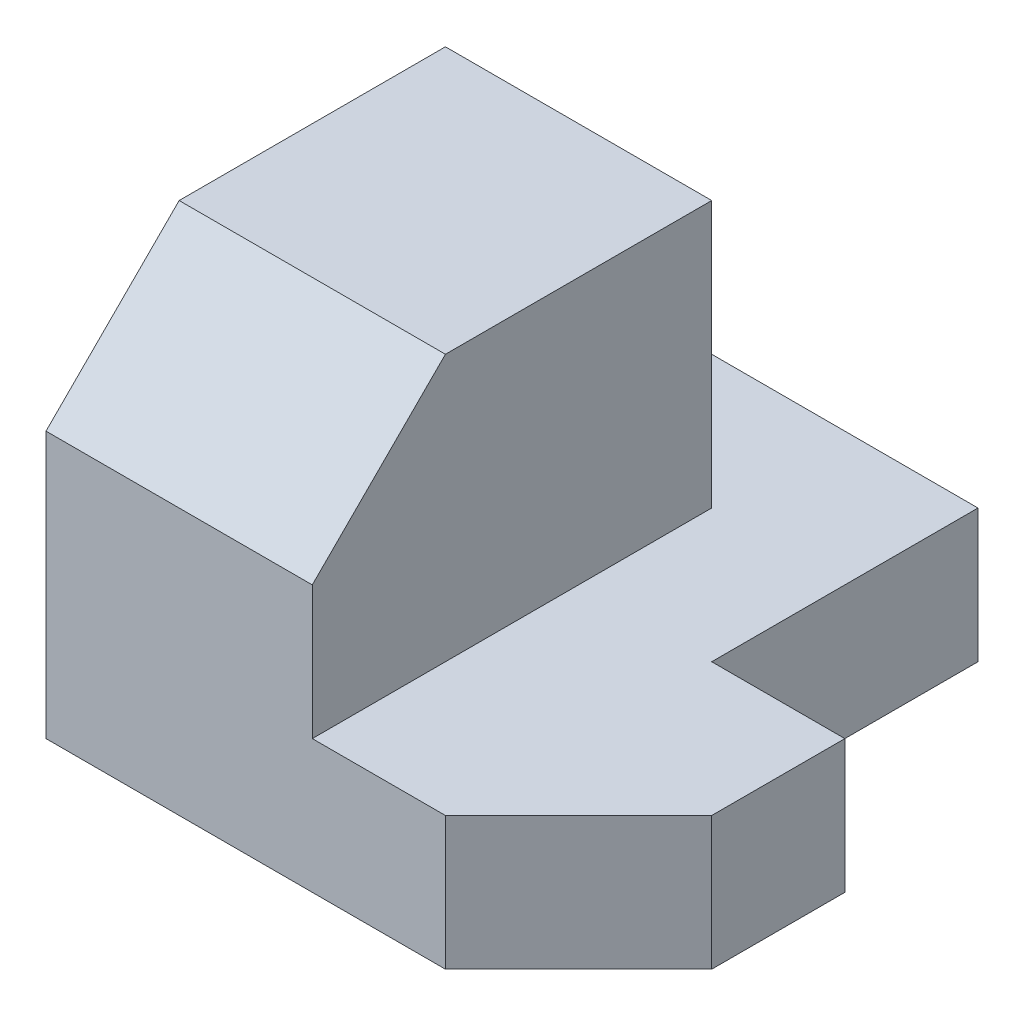
ISO-10303-21;
HEADER;
FILE_DESCRIPTION(('STEP AP214'),'2;1');
FILE_NAME('part.step','',(''),(''),'','','');
FILE_SCHEMA(('AUTOMOTIVE_DESIGN { 1 0 10303 214 1 1 1 1 }'));
ENDSEC;
DATA;
#1=APPLICATION_CONTEXT('core data for automotive mechanical design processes');
#2=APPLICATION_PROTOCOL_DEFINITION('international standard','automotive_design',2000,#1);
#3=PRODUCT_CONTEXT('',#1,'mechanical');
#4=PRODUCT('Part','Part','',(#3));
#5=PRODUCT_RELATED_PRODUCT_CATEGORY('part','',(#4));
#6=PRODUCT_DEFINITION_FORMATION('','',#4);
#7=PRODUCT_DEFINITION_CONTEXT('part definition',#1,'design');
#8=PRODUCT_DEFINITION('design','',#6,#7);
#9=PRODUCT_DEFINITION_SHAPE('','',#8);
#10=(LENGTH_UNIT() NAMED_UNIT(*) SI_UNIT(.MILLI.,.METRE.));
#11=(NAMED_UNIT(*) PLANE_ANGLE_UNIT() SI_UNIT($,.RADIAN.));
#12=(NAMED_UNIT(*) SI_UNIT($,.STERADIAN.) SOLID_ANGLE_UNIT());
#13=UNCERTAINTY_MEASURE_WITH_UNIT(LENGTH_MEASURE(1.E-05),#10,'distance_accuracy_value','');
#14=(GEOMETRIC_REPRESENTATION_CONTEXT(3) GLOBAL_UNCERTAINTY_ASSIGNED_CONTEXT((#13)) GLOBAL_UNIT_ASSIGNED_CONTEXT((#10,
#11,#12)) REPRESENTATION_CONTEXT('',''));
#15=CARTESIAN_POINT('',(0.,0.,0.));
#16=DIRECTION('',(0.,0.,1.));
#17=DIRECTION('',(1.,0.,0.));
#18=AXIS2_PLACEMENT_3D('',#15,#16,#17);
#19=CARTESIAN_POINT('',(0.,254.,0.));
#20=DIRECTION('',(0.,0.,1.));
#21=DIRECTION('',(1.,0.,0.));
#22=AXIS2_PLACEMENT_3D('',#19,#20,#21);
#23=PLANE('',#22);
#24=DIRECTION('',(0.,-1.,0.));
#25=VECTOR('',#24,1.);
#26=CARTESIAN_POINT('',(508.,762.,0.));
#27=LINE('',#26,#25);
#28=CARTESIAN_POINT('',(508.,508.,0.));
#29=VERTEX_POINT('',#28);
#30=CARTESIAN_POINT('',(508.,254.,0.));
#31=VERTEX_POINT('',#30);
#32=EDGE_CURVE('E184',#29,#31,#27,.T.);
#33=ORIENTED_EDGE('',*,*,#32,.F.);
#34=DIRECTION('',(1.,0.,0.));
#35=VECTOR('',#34,1.);
#36=CARTESIAN_POINT('',(-2985.49194538493,508.,0.));
#37=LINE('',#36,#35);
#38=CARTESIAN_POINT('',(0.,508.,0.));
#39=VERTEX_POINT('',#38);
#40=EDGE_CURVE('E206',#39,#29,#37,.T.);
#41=ORIENTED_EDGE('',*,*,#40,.F.);
#42=DIRECTION('',(0.,-1.,0.));
#43=VECTOR('',#42,1.);
#44=CARTESIAN_POINT('',(0.,762.,0.));
#45=LINE('',#44,#43);
#46=CARTESIAN_POINT('',(0.,0.,0.));
#47=VERTEX_POINT('',#46);
#48=EDGE_CURVE('E137',#39,#47,#45,.T.);
#49=ORIENTED_EDGE('',*,*,#48,.T.);
#50=DIRECTION('',(-1.,0.,0.));
#51=VECTOR('',#50,1.);
#52=CARTESIAN_POINT('',(0.,0.,0.));
#53=LINE('',#52,#51);
#54=CARTESIAN_POINT('',(762.,0.,-1.11022302462516E-13));
#55=VERTEX_POINT('',#54);
#56=EDGE_CURVE('E133',#55,#47,#53,.T.);
#57=ORIENTED_EDGE('',*,*,#56,.F.);
#58=DIRECTION('',(0.,-1.,0.));
#59=VECTOR('',#58,1.);
#60=CARTESIAN_POINT('',(762.,254.,-1.11022302462516E-13));
#61=LINE('',#60,#59);
#62=CARTESIAN_POINT('',(762.,254.,-1.11022302462516E-13));
#63=VERTEX_POINT('',#62);
#64=EDGE_CURVE('E11',#63,#55,#61,.T.);
#65=ORIENTED_EDGE('',*,*,#64,.F.);
#66=DIRECTION('',(-1.,0.,0.));
#67=VECTOR('',#66,1.);
#68=CARTESIAN_POINT('',(0.,254.,0.));
#69=LINE('',#68,#67);
#70=EDGE_CURVE('E174',#63,#31,#69,.T.);
#71=ORIENTED_EDGE('',*,*,#70,.T.);
#72=EDGE_LOOP('',(#33,#41,#49,#57,#65,#71));
#73=FACE_BOUND('',#72,.T.);
#74=ADVANCED_FACE('F33',(#73),#23,.T.);
#75=CARTESIAN_POINT('',(0.,254.,0.));
#76=DIRECTION('',(-1.,0.,0.));
#77=DIRECTION('',(0.,0.,1.));
#78=AXIS2_PLACEMENT_3D('',#75,#76,#77);
#79=PLANE('',#78);
#80=ORIENTED_EDGE('',*,*,#48,.F.);
#81=DIRECTION('',(0.,-0.707106781186551,0.707106781186544));
#82=VECTOR('',#81,1.);
#83=CARTESIAN_POINT('',(0.,762.,-253.999999999997));
#84=LINE('',#83,#82);
#85=CARTESIAN_POINT('',(0.,762.,-253.999999999997));
#86=VERTEX_POINT('',#85);
#87=EDGE_CURVE('E201',#86,#39,#84,.T.);
#88=ORIENTED_EDGE('',*,*,#87,.F.);
#89=DIRECTION('',(0.,0.,-1.));
#90=VECTOR('',#89,1.);
#91=CARTESIAN_POINT('',(0.,762.,0.));
#92=LINE('',#91,#90);
#93=CARTESIAN_POINT('',(0.,762.,-762.));
#94=VERTEX_POINT('',#93);
#95=EDGE_CURVE('E198',#86,#94,#92,.T.);
#96=ORIENTED_EDGE('',*,*,#95,.T.);
#97=DIRECTION('',(0.,-1.,0.));
#98=VECTOR('',#97,1.);
#99=CARTESIAN_POINT('',(0.,762.,-762.));
#100=LINE('',#99,#98);
#101=CARTESIAN_POINT('',(0.,254.,-762.));
#102=VERTEX_POINT('',#101);
#103=EDGE_CURVE('E189',#94,#102,#100,.T.);
#104=ORIENTED_EDGE('',*,*,#103,.T.);
#105=DIRECTION('',(0.,0.,-1.));
#106=VECTOR('',#105,1.);
#107=CARTESIAN_POINT('',(0.,254.,0.));
#108=LINE('',#107,#106);
#109=CARTESIAN_POINT('',(0.,254.,-1016.));
#110=VERTEX_POINT('',#109);
#111=EDGE_CURVE('E56',#102,#110,#108,.T.);
#112=ORIENTED_EDGE('',*,*,#111,.T.);
#113=DIRECTION('',(0.,-1.,0.));
#114=VECTOR('',#113,1.);
#115=CARTESIAN_POINT('',(0.,254.,-1016.));
#116=LINE('',#115,#114);
#117=CARTESIAN_POINT('',(0.,0.,-1016.));
#118=VERTEX_POINT('',#117);
#119=EDGE_CURVE('E82',#110,#118,#116,.T.);
#120=ORIENTED_EDGE('',*,*,#119,.T.);
#121=DIRECTION('',(0.,0.,-1.));
#122=VECTOR('',#121,1.);
#123=CARTESIAN_POINT('',(0.,0.,0.));
#124=LINE('',#123,#122);
#125=EDGE_CURVE('E149',#47,#118,#124,.T.);
#126=ORIENTED_EDGE('',*,*,#125,.F.);
#127=EDGE_LOOP('',(#80,#88,#96,#104,#112,#120,#126));
#128=FACE_BOUND('',#127,.T.);
#129=ADVANCED_FACE('F233',(#128),#79,.T.);
#130=CARTESIAN_POINT('',(508.,762.,0.));
#131=DIRECTION('',(1.,0.,0.));
#132=DIRECTION('',(0.,0.,-1.));
#133=AXIS2_PLACEMENT_3D('',#130,#131,#132);
#134=PLANE('',#133);
#135=DIRECTION('',(0.,0.,1.));
#136=VECTOR('',#135,1.);
#137=CARTESIAN_POINT('',(508.,762.,0.));
#138=LINE('',#137,#136);
#139=CARTESIAN_POINT('',(508.,762.,-762.));
#140=VERTEX_POINT('',#139);
#141=CARTESIAN_POINT('',(508.,762.,-253.999999999997));
#142=VERTEX_POINT('',#141);
#143=EDGE_CURVE('E195',#140,#142,#138,.T.);
#144=ORIENTED_EDGE('',*,*,#143,.T.);
#145=DIRECTION('',(0.,-0.707106781186551,0.707106781186544));
#146=VECTOR('',#145,1.);
#147=CARTESIAN_POINT('',(508.,762.,-253.999999999997));
#148=LINE('',#147,#146);
#149=EDGE_CURVE('E47',#142,#29,#148,.T.);
#150=ORIENTED_EDGE('',*,*,#149,.T.);
#151=ORIENTED_EDGE('',*,*,#32,.T.);
#152=DIRECTION('',(0.,0.,1.));
#153=VECTOR('',#152,1.);
#154=CARTESIAN_POINT('',(508.,254.,0.));
#155=LINE('',#154,#153);
#156=CARTESIAN_POINT('',(508.,254.,-762.));
#157=VERTEX_POINT('',#156);
#158=EDGE_CURVE('E179',#157,#31,#155,.T.);
#159=ORIENTED_EDGE('',*,*,#158,.F.);
#160=DIRECTION('',(0.,-1.,0.));
#161=VECTOR('',#160,1.);
#162=CARTESIAN_POINT('',(508.,762.,-762.));
#163=LINE('',#162,#161);
#164=EDGE_CURVE('E186',#140,#157,#163,.T.);
#165=ORIENTED_EDGE('',*,*,#164,.F.);
#166=EDGE_LOOP('',(#144,#150,#151,#159,#165));
#167=FACE_BOUND('',#166,.T.);
#168=ADVANCED_FACE('F211',(#167),#134,.T.);
#169=CARTESIAN_POINT('',(0.,762.,0.));
#170=DIRECTION('',(0.,1.,0.));
#171=DIRECTION('',(0.,0.,1.));
#172=AXIS2_PLACEMENT_3D('',#169,#170,#171);
#173=PLANE('',#172);
#174=ORIENTED_EDGE('',*,*,#95,.F.);
#175=DIRECTION('',(1.,0.,0.));
#176=VECTOR('',#175,1.);
#177=CARTESIAN_POINT('',(-2985.49194538493,762.,-253.999999999997));
#178=LINE('',#177,#176);
#179=EDGE_CURVE('E204',#86,#142,#178,.T.);
#180=ORIENTED_EDGE('',*,*,#179,.T.);
#181=ORIENTED_EDGE('',*,*,#143,.F.);
#182=DIRECTION('',(1.,0.,0.));
#183=VECTOR('',#182,1.);
#184=CARTESIAN_POINT('',(0.,762.,-762.));
#185=LINE('',#184,#183);
#186=EDGE_CURVE('E192',#94,#140,#185,.T.);
#187=ORIENTED_EDGE('',*,*,#186,.F.);
#188=EDGE_LOOP('',(#174,#180,#181,#187));
#189=FACE_BOUND('',#188,.T.);
#190=ADVANCED_FACE('F227',(#189),#173,.T.);
#191=CARTESIAN_POINT('',(381.,254.,381.));
#192=DIRECTION('',(0.707106781186548,0.,0.707106781186548));
#193=DIRECTION('',(0.707106781186548,0.,-0.707106781186548));
#194=AXIS2_PLACEMENT_3D('',#191,#192,#193);
#195=PLANE('',#194);
#196=DIRECTION('',(-0.707106781186548,0.,0.707106781186548));
#197=VECTOR('',#196,1.);
#198=CARTESIAN_POINT('',(381.,0.,381.));
#199=LINE('',#198,#197);
#200=CARTESIAN_POINT('',(1016.,0.,-254.));
#201=VERTEX_POINT('',#200);
#202=EDGE_CURVE('E136',#201,#55,#199,.T.);
#203=ORIENTED_EDGE('',*,*,#202,.F.);
#204=DIRECTION('',(0.,-1.,0.));
#205=VECTOR('',#204,1.);
#206=CARTESIAN_POINT('',(1016.,254.,-254.));
#207=LINE('',#206,#205);
#208=CARTESIAN_POINT('',(1016.,254.,-254.));
#209=VERTEX_POINT('',#208);
#210=EDGE_CURVE('E40',#209,#201,#207,.T.);
#211=ORIENTED_EDGE('',*,*,#210,.F.);
#212=DIRECTION('',(-0.707106781186548,0.,0.707106781186548));
#213=VECTOR('',#212,1.);
#214=CARTESIAN_POINT('',(381.,254.,381.));
#215=LINE('',#214,#213);
#216=EDGE_CURVE('E172',#209,#63,#215,.T.);
#217=ORIENTED_EDGE('',*,*,#216,.T.);
#218=ORIENTED_EDGE('',*,*,#64,.T.);
#219=EDGE_LOOP('',(#203,#211,#217,#218));
#220=FACE_BOUND('',#219,.T.);
#221=ADVANCED_FACE('F164',(#220),#195,.T.);
#222=CARTESIAN_POINT('',(1016.,254.,0.));
#223=DIRECTION('',(1.,0.,0.));
#224=DIRECTION('',(0.,0.,-1.));
#225=AXIS2_PLACEMENT_3D('',#222,#223,#224);
#226=PLANE('',#225);
#227=DIRECTION('',(0.,0.,1.));
#228=VECTOR('',#227,1.);
#229=CARTESIAN_POINT('',(1016.,0.,0.));
#230=LINE('',#229,#228);
#231=CARTESIAN_POINT('',(1016.,0.,-508.));
#232=VERTEX_POINT('',#231);
#233=EDGE_CURVE('E140',#232,#201,#230,.T.);
#234=ORIENTED_EDGE('',*,*,#233,.F.);
#235=DIRECTION('',(0.,-1.,0.));
#236=VECTOR('',#235,1.);
#237=CARTESIAN_POINT('',(1016.,254.,-508.));
#238=LINE('',#237,#236);
#239=CARTESIAN_POINT('',(1016.,254.,-508.));
#240=VERTEX_POINT('',#239);
#241=EDGE_CURVE('E154',#240,#232,#238,.T.);
#242=ORIENTED_EDGE('',*,*,#241,.F.);
#243=DIRECTION('',(0.,0.,1.));
#244=VECTOR('',#243,1.);
#245=CARTESIAN_POINT('',(1016.,254.,0.));
#246=LINE('',#245,#244);
#247=EDGE_CURVE('E160',#240,#209,#246,.T.);
#248=ORIENTED_EDGE('',*,*,#247,.T.);
#249=ORIENTED_EDGE('',*,*,#210,.T.);
#250=EDGE_LOOP('',(#234,#242,#248,#249));
#251=FACE_BOUND('',#250,.T.);
#252=ADVANCED_FACE('F159',(#251),#226,.T.);
#253=CARTESIAN_POINT('',(0.,254.,-508.));
#254=DIRECTION('',(0.,0.,-1.));
#255=DIRECTION('',(-1.,0.,0.));
#256=AXIS2_PLACEMENT_3D('',#253,#254,#255);
#257=PLANE('',#256);
#258=DIRECTION('',(1.,0.,0.));
#259=VECTOR('',#258,1.);
#260=CARTESIAN_POINT('',(0.,0.,-508.));
#261=LINE('',#260,#259);
#262=CARTESIAN_POINT('',(762.,0.,-508.));
#263=VERTEX_POINT('',#262);
#264=EDGE_CURVE('E143',#263,#232,#261,.T.);
#265=ORIENTED_EDGE('',*,*,#264,.F.);
#266=DIRECTION('',(0.,-1.,0.));
#267=VECTOR('',#266,1.);
#268=CARTESIAN_POINT('',(762.,254.,-508.));
#269=LINE('',#268,#267);
#270=CARTESIAN_POINT('',(762.,254.,-508.));
#271=VERTEX_POINT('',#270);
#272=EDGE_CURVE('E119',#271,#263,#269,.T.);
#273=ORIENTED_EDGE('',*,*,#272,.F.);
#274=DIRECTION('',(1.,0.,0.));
#275=VECTOR('',#274,1.);
#276=CARTESIAN_POINT('',(0.,254.,-508.));
#277=LINE('',#276,#275);
#278=EDGE_CURVE('E126',#271,#240,#277,.T.);
#279=ORIENTED_EDGE('',*,*,#278,.T.);
#280=ORIENTED_EDGE('',*,*,#241,.T.);
#281=EDGE_LOOP('',(#265,#273,#279,#280));
#282=FACE_BOUND('',#281,.T.);
#283=ADVANCED_FACE('F170',(#282),#257,.T.);
#284=CARTESIAN_POINT('',(762.,254.,-3.33066907387547E-13));
#285=DIRECTION('',(1.,0.,0.));
#286=DIRECTION('',(0.,0.,-1.));
#287=AXIS2_PLACEMENT_3D('',#284,#285,#286);
#288=PLANE('',#287);
#289=DIRECTION('',(0.,0.,1.));
#290=VECTOR('',#289,1.);
#291=CARTESIAN_POINT('',(762.,0.,-3.33066907387547E-13));
#292=LINE('',#291,#290);
#293=CARTESIAN_POINT('',(762.,0.,-1016.));
#294=VERTEX_POINT('',#293);
#295=EDGE_CURVE('E115',#294,#263,#292,.T.);
#296=ORIENTED_EDGE('',*,*,#295,.F.);
#297=DIRECTION('',(0.,-1.,0.));
#298=VECTOR('',#297,1.);
#299=CARTESIAN_POINT('',(762.,254.,-1016.));
#300=LINE('',#299,#298);
#301=CARTESIAN_POINT('',(762.,254.,-1016.));
#302=VERTEX_POINT('',#301);
#303=EDGE_CURVE('E110',#302,#294,#300,.T.);
#304=ORIENTED_EDGE('',*,*,#303,.F.);
#305=DIRECTION('',(0.,0.,1.));
#306=VECTOR('',#305,1.);
#307=CARTESIAN_POINT('',(762.,254.,-3.33066907387547E-13));
#308=LINE('',#307,#306);
#309=EDGE_CURVE('E113',#302,#271,#308,.T.);
#310=ORIENTED_EDGE('',*,*,#309,.T.);
#311=ORIENTED_EDGE('',*,*,#272,.T.);
#312=EDGE_LOOP('',(#296,#304,#310,#311));
#313=FACE_BOUND('',#312,.T.);
#314=ADVANCED_FACE('F112',(#313),#288,.T.);
#315=CARTESIAN_POINT('',(0.,254.,-1016.));
#316=DIRECTION('',(0.,0.,-1.));
#317=DIRECTION('',(-1.,0.,0.));
#318=AXIS2_PLACEMENT_3D('',#315,#316,#317);
#319=PLANE('',#318);
#320=DIRECTION('',(1.,0.,0.));
#321=VECTOR('',#320,1.);
#322=CARTESIAN_POINT('',(0.,0.,-1016.));
#323=LINE('',#322,#321);
#324=EDGE_CURVE('E147',#118,#294,#323,.T.);
#325=ORIENTED_EDGE('',*,*,#324,.F.);
#326=ORIENTED_EDGE('',*,*,#119,.F.);
#327=DIRECTION('',(1.,0.,0.));
#328=VECTOR('',#327,1.);
#329=CARTESIAN_POINT('',(0.,254.,-1016.));
#330=LINE('',#329,#328);
#331=EDGE_CURVE('E123',#110,#302,#330,.T.);
#332=ORIENTED_EDGE('',*,*,#331,.T.);
#333=ORIENTED_EDGE('',*,*,#303,.T.);
#334=EDGE_LOOP('',(#325,#326,#332,#333));
#335=FACE_BOUND('',#334,.T.);
#336=ADVANCED_FACE('F128',(#335),#319,.T.);
#337=CARTESIAN_POINT('',(0.,254.,0.));
#338=DIRECTION('',(0.,1.,0.));
#339=DIRECTION('',(0.,0.,1.));
#340=AXIS2_PLACEMENT_3D('',#337,#338,#339);
#341=PLANE('',#340);
#342=DIRECTION('',(1.,0.,0.));
#343=VECTOR('',#342,1.);
#344=CARTESIAN_POINT('',(0.,254.,-762.));
#345=LINE('',#344,#343);
#346=EDGE_CURVE('E87',#102,#157,#345,.T.);
#347=ORIENTED_EDGE('',*,*,#346,.T.);
#348=ORIENTED_EDGE('',*,*,#158,.T.);
#349=ORIENTED_EDGE('',*,*,#70,.F.);
#350=ORIENTED_EDGE('',*,*,#216,.F.);
#351=ORIENTED_EDGE('',*,*,#247,.F.);
#352=ORIENTED_EDGE('',*,*,#278,.F.);
#353=ORIENTED_EDGE('',*,*,#309,.F.);
#354=ORIENTED_EDGE('',*,*,#331,.F.);
#355=ORIENTED_EDGE('',*,*,#111,.F.);
#356=EDGE_LOOP('',(#347,#348,#349,#350,#351,#352,#353,#354,#355));
#357=FACE_BOUND('',#356,.T.);
#358=ADVANCED_FACE('F122',(#357),#341,.T.);
#359=CARTESIAN_POINT('',(0.,0.,0.));
#360=DIRECTION('',(0.,1.,0.));
#361=DIRECTION('',(0.,0.,1.));
#362=AXIS2_PLACEMENT_3D('',#359,#360,#361);
#363=PLANE('',#362);
#364=ORIENTED_EDGE('',*,*,#56,.T.);
#365=ORIENTED_EDGE('',*,*,#125,.T.);
#366=ORIENTED_EDGE('',*,*,#324,.T.);
#367=ORIENTED_EDGE('',*,*,#295,.T.);
#368=ORIENTED_EDGE('',*,*,#264,.T.);
#369=ORIENTED_EDGE('',*,*,#233,.T.);
#370=ORIENTED_EDGE('',*,*,#202,.T.);
#371=EDGE_LOOP('',(#364,#365,#366,#367,#368,#369,#370));
#372=FACE_BOUND('',#371,.T.);
#373=ADVANCED_FACE('F167',(#372),#363,.F.);
#374=CARTESIAN_POINT('',(0.,762.,-762.));
#375=DIRECTION('',(0.,0.,-1.));
#376=DIRECTION('',(-1.,0.,0.));
#377=AXIS2_PLACEMENT_3D('',#374,#375,#376);
#378=PLANE('',#377);
#379=ORIENTED_EDGE('',*,*,#164,.T.);
#380=ORIENTED_EDGE('',*,*,#346,.F.);
#381=ORIENTED_EDGE('',*,*,#103,.F.);
#382=ORIENTED_EDGE('',*,*,#186,.T.);
#383=EDGE_LOOP('',(#379,#380,#381,#382));
#384=FACE_BOUND('',#383,.T.);
#385=ADVANCED_FACE('F221',(#384),#378,.T.);
#386=CARTESIAN_POINT('',(-2985.49194538493,762.,-253.999999999997));
#387=DIRECTION('',(0.,0.707106781186544,0.707106781186551));
#388=DIRECTION('',(0.,-0.707106781186551,0.707106781186544));
#389=AXIS2_PLACEMENT_3D('',#386,#387,#388);
#390=PLANE('',#389);
#391=ORIENTED_EDGE('',*,*,#179,.F.);
#392=ORIENTED_EDGE('',*,*,#87,.T.);
#393=ORIENTED_EDGE('',*,*,#40,.T.);
#394=ORIENTED_EDGE('',*,*,#149,.F.);
#395=EDGE_LOOP('',(#391,#392,#393,#394));
#396=FACE_BOUND('',#395,.T.);
#397=ADVANCED_FACE('F232',(#396),#390,.T.);
#398=CLOSED_SHELL('',(#74,#129,#168,#190,#221,#252,#283,#314,#336,#358,#373,#385,#397));
#399=MANIFOLD_SOLID_BREP('B2',#398);
#400=ADVANCED_BREP_SHAPE_REPRESENTATION('',(#18,#399),#14);
#401=SHAPE_DEFINITION_REPRESENTATION(#9,#400);
ENDSEC;
END-ISO-10303-21;
